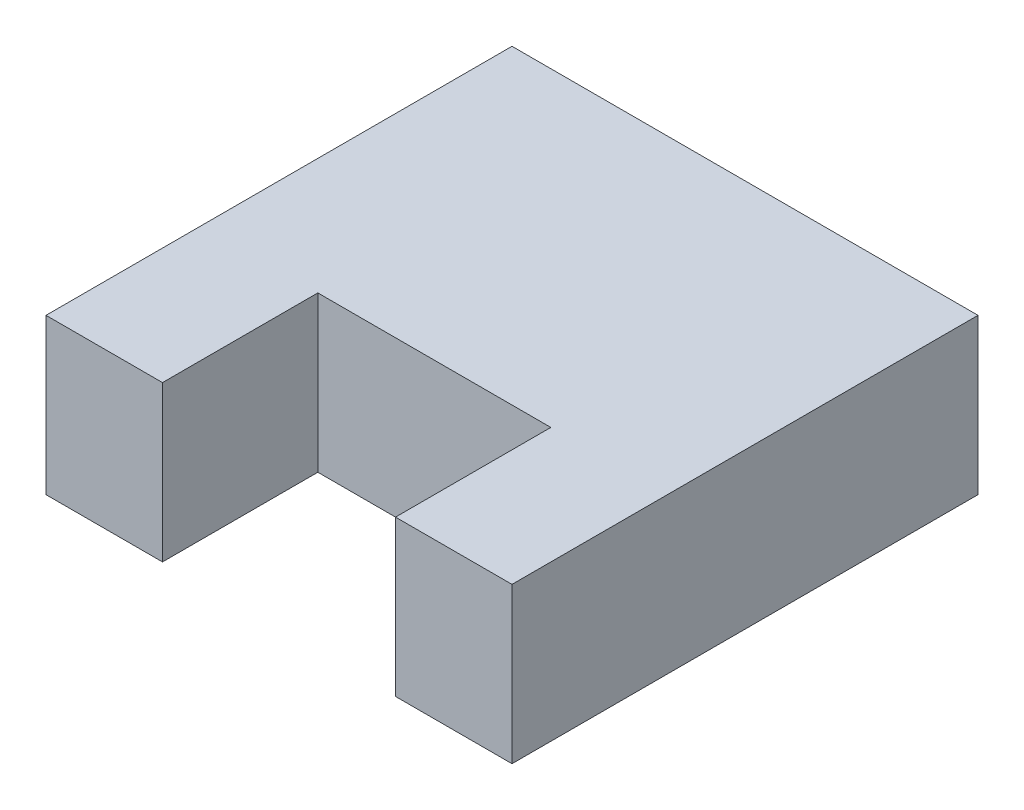
ISO-10303-21;
HEADER;
FILE_DESCRIPTION(('STEP AP214'),'2;1');
FILE_NAME('part.step','',(''),(''),'','','');
FILE_SCHEMA(('AUTOMOTIVE_DESIGN { 1 0 10303 214 1 1 1 1 }'));
ENDSEC;
DATA;
#1=APPLICATION_CONTEXT('core data for automotive mechanical design processes');
#2=APPLICATION_PROTOCOL_DEFINITION('international standard','automotive_design',2000,#1);
#3=PRODUCT_CONTEXT('',#1,'mechanical');
#4=PRODUCT('Part','Part','',(#3));
#5=PRODUCT_RELATED_PRODUCT_CATEGORY('part','',(#4));
#6=PRODUCT_DEFINITION_FORMATION('','',#4);
#7=PRODUCT_DEFINITION_CONTEXT('part definition',#1,'design');
#8=PRODUCT_DEFINITION('design','',#6,#7);
#9=PRODUCT_DEFINITION_SHAPE('','',#8);
#10=(LENGTH_UNIT() NAMED_UNIT(*) SI_UNIT(.MILLI.,.METRE.));
#11=(NAMED_UNIT(*) PLANE_ANGLE_UNIT() SI_UNIT($,.RADIAN.));
#12=(NAMED_UNIT(*) SI_UNIT($,.STERADIAN.) SOLID_ANGLE_UNIT());
#13=UNCERTAINTY_MEASURE_WITH_UNIT(LENGTH_MEASURE(1.E-05),#10,'distance_accuracy_value','');
#14=(GEOMETRIC_REPRESENTATION_CONTEXT(3) GLOBAL_UNCERTAINTY_ASSIGNED_CONTEXT((#13)) GLOBAL_UNIT_ASSIGNED_CONTEXT((#10,
#11,#12)) REPRESENTATION_CONTEXT('',''));
#15=CARTESIAN_POINT('',(0.,0.,0.));
#16=DIRECTION('',(0.,0.,1.));
#17=DIRECTION('',(1.,0.,0.));
#18=AXIS2_PLACEMENT_3D('',#15,#16,#17);
#19=CARTESIAN_POINT('',(0.,10.,60.));
#20=DIRECTION('',(1.,0.,0.));
#21=DIRECTION('',(0.,0.,-1.));
#22=AXIS2_PLACEMENT_3D('',#19,#20,#21);
#23=PLANE('',#22);
#24=DIRECTION('',(0.,0.,1.));
#25=VECTOR('',#24,1.);
#26=CARTESIAN_POINT('',(0.,-10.,60.));
#27=LINE('',#26,#25);
#28=CARTESIAN_POINT('',(0.,-10.,0.));
#29=VERTEX_POINT('',#28);
#30=CARTESIAN_POINT('',(0.,-10.,60.));
#31=VERTEX_POINT('',#30);
#32=EDGE_CURVE('E140',#29,#31,#27,.T.);
#33=ORIENTED_EDGE('',*,*,#32,.T.);
#34=DIRECTION('',(0.,-1.,0.));
#35=VECTOR('',#34,1.);
#36=CARTESIAN_POINT('',(0.,10.,60.));
#37=LINE('',#36,#35);
#38=CARTESIAN_POINT('',(0.,10.,60.));
#39=VERTEX_POINT('',#38);
#40=EDGE_CURVE('E11',#39,#31,#37,.T.);
#41=ORIENTED_EDGE('',*,*,#40,.F.);
#42=DIRECTION('',(0.,0.,1.));
#43=VECTOR('',#42,1.);
#44=CARTESIAN_POINT('',(0.,10.,60.));
#45=LINE('',#44,#43);
#46=CARTESIAN_POINT('',(0.,10.,0.));
#47=VERTEX_POINT('',#46);
#48=EDGE_CURVE('E162',#47,#39,#45,.T.);
#49=ORIENTED_EDGE('',*,*,#48,.F.);
#50=DIRECTION('',(0.,-1.,0.));
#51=VECTOR('',#50,1.);
#52=CARTESIAN_POINT('',(0.,10.,0.));
#53=LINE('',#52,#51);
#54=EDGE_CURVE('E136',#47,#29,#53,.T.);
#55=ORIENTED_EDGE('',*,*,#54,.T.);
#56=EDGE_LOOP('',(#33,#41,#49,#55));
#57=FACE_BOUND('',#56,.T.);
#58=ADVANCED_FACE('F39',(#57),#23,.F.);
#59=CARTESIAN_POINT('',(15.,10.,60.));
#60=DIRECTION('',(0.,0.,-1.));
#61=DIRECTION('',(-1.,0.,0.));
#62=AXIS2_PLACEMENT_3D('',#59,#60,#61);
#63=PLANE('',#62);
#64=DIRECTION('',(1.,0.,0.));
#65=VECTOR('',#64,1.);
#66=CARTESIAN_POINT('',(15.,-10.,60.));
#67=LINE('',#66,#65);
#68=CARTESIAN_POINT('',(15.,-10.,60.));
#69=VERTEX_POINT('',#68);
#70=EDGE_CURVE('E144',#31,#69,#67,.T.);
#71=ORIENTED_EDGE('',*,*,#70,.T.);
#72=DIRECTION('',(0.,-1.,0.));
#73=VECTOR('',#72,1.);
#74=CARTESIAN_POINT('',(15.,10.,60.));
#75=LINE('',#74,#73);
#76=CARTESIAN_POINT('',(15.,10.,60.));
#77=VERTEX_POINT('',#76);
#78=EDGE_CURVE('E48',#77,#69,#75,.T.);
#79=ORIENTED_EDGE('',*,*,#78,.F.);
#80=DIRECTION('',(1.,0.,0.));
#81=VECTOR('',#80,1.);
#82=CARTESIAN_POINT('',(15.,10.,60.));
#83=LINE('',#82,#81);
#84=EDGE_CURVE('E99',#39,#77,#83,.T.);
#85=ORIENTED_EDGE('',*,*,#84,.F.);
#86=ORIENTED_EDGE('',*,*,#40,.T.);
#87=EDGE_LOOP('',(#71,#79,#85,#86));
#88=FACE_BOUND('',#87,.T.);
#89=ADVANCED_FACE('F208',(#88),#63,.F.);
#90=CARTESIAN_POINT('',(15.,10.,40.));
#91=DIRECTION('',(-1.,0.,0.));
#92=DIRECTION('',(0.,0.,1.));
#93=AXIS2_PLACEMENT_3D('',#90,#91,#92);
#94=PLANE('',#93);
#95=DIRECTION('',(0.,0.,-1.));
#96=VECTOR('',#95,1.);
#97=CARTESIAN_POINT('',(15.,-10.,40.));
#98=LINE('',#97,#96);
#99=CARTESIAN_POINT('',(15.,-10.,40.));
#100=VERTEX_POINT('',#99);
#101=EDGE_CURVE('E147',#69,#100,#98,.T.);
#102=ORIENTED_EDGE('',*,*,#101,.T.);
#103=DIRECTION('',(0.,-1.,0.));
#104=VECTOR('',#103,1.);
#105=CARTESIAN_POINT('',(15.,10.,40.));
#106=LINE('',#105,#104);
#107=CARTESIAN_POINT('',(15.,10.,40.));
#108=VERTEX_POINT('',#107);
#109=EDGE_CURVE('E173',#108,#100,#106,.T.);
#110=ORIENTED_EDGE('',*,*,#109,.F.);
#111=DIRECTION('',(0.,0.,-1.));
#112=VECTOR('',#111,1.);
#113=CARTESIAN_POINT('',(15.,10.,40.));
#114=LINE('',#113,#112);
#115=EDGE_CURVE('E183',#77,#108,#114,.T.);
#116=ORIENTED_EDGE('',*,*,#115,.F.);
#117=ORIENTED_EDGE('',*,*,#78,.T.);
#118=EDGE_LOOP('',(#102,#110,#116,#117));
#119=FACE_BOUND('',#118,.T.);
#120=ADVANCED_FACE('F181',(#119),#94,.F.);
#121=CARTESIAN_POINT('',(45.,10.,40.));
#122=DIRECTION('',(0.,0.,-1.));
#123=DIRECTION('',(-1.,0.,0.));
#124=AXIS2_PLACEMENT_3D('',#121,#122,#123);
#125=PLANE('',#124);
#126=DIRECTION('',(1.,0.,0.));
#127=VECTOR('',#126,1.);
#128=CARTESIAN_POINT('',(45.,-10.,40.));
#129=LINE('',#128,#127);
#130=CARTESIAN_POINT('',(45.,-10.,40.));
#131=VERTEX_POINT('',#130);
#132=EDGE_CURVE('E150',#100,#131,#129,.T.);
#133=ORIENTED_EDGE('',*,*,#132,.T.);
#134=DIRECTION('',(0.,-1.,0.));
#135=VECTOR('',#134,1.);
#136=CARTESIAN_POINT('',(45.,10.,40.));
#137=LINE('',#136,#135);
#138=CARTESIAN_POINT('',(45.,10.,40.));
#139=VERTEX_POINT('',#138);
#140=EDGE_CURVE('E169',#139,#131,#137,.T.);
#141=ORIENTED_EDGE('',*,*,#140,.F.);
#142=DIRECTION('',(1.,0.,0.));
#143=VECTOR('',#142,1.);
#144=CARTESIAN_POINT('',(45.,10.,40.));
#145=LINE('',#144,#143);
#146=EDGE_CURVE('E196',#108,#139,#145,.T.);
#147=ORIENTED_EDGE('',*,*,#146,.F.);
#148=ORIENTED_EDGE('',*,*,#109,.T.);
#149=EDGE_LOOP('',(#133,#141,#147,#148));
#150=FACE_BOUND('',#149,.T.);
#151=ADVANCED_FACE('F191',(#150),#125,.F.);
#152=CARTESIAN_POINT('',(45.,10.,60.));
#153=DIRECTION('',(1.,0.,0.));
#154=DIRECTION('',(0.,0.,-1.));
#155=AXIS2_PLACEMENT_3D('',#152,#153,#154);
#156=PLANE('',#155);
#157=DIRECTION('',(0.,0.,1.));
#158=VECTOR('',#157,1.);
#159=CARTESIAN_POINT('',(45.,-10.,60.));
#160=LINE('',#159,#158);
#161=CARTESIAN_POINT('',(45.,-10.,60.));
#162=VERTEX_POINT('',#161);
#163=EDGE_CURVE('E153',#131,#162,#160,.T.);
#164=ORIENTED_EDGE('',*,*,#163,.T.);
#165=DIRECTION('',(0.,-1.,0.));
#166=VECTOR('',#165,1.);
#167=CARTESIAN_POINT('',(45.,10.,60.));
#168=LINE('',#167,#166);
#169=CARTESIAN_POINT('',(45.,10.,60.));
#170=VERTEX_POINT('',#169);
#171=EDGE_CURVE('E129',#170,#162,#168,.T.);
#172=ORIENTED_EDGE('',*,*,#171,.F.);
#173=DIRECTION('',(0.,0.,1.));
#174=VECTOR('',#173,1.);
#175=CARTESIAN_POINT('',(45.,10.,60.));
#176=LINE('',#175,#174);
#177=EDGE_CURVE('E118',#139,#170,#176,.T.);
#178=ORIENTED_EDGE('',*,*,#177,.F.);
#179=ORIENTED_EDGE('',*,*,#140,.T.);
#180=EDGE_LOOP('',(#164,#172,#178,#179));
#181=FACE_BOUND('',#180,.T.);
#182=ADVANCED_FACE('F194',(#181),#156,.F.);
#183=CARTESIAN_POINT('',(60.,10.,60.));
#184=DIRECTION('',(0.,0.,-1.));
#185=DIRECTION('',(-1.,0.,0.));
#186=AXIS2_PLACEMENT_3D('',#183,#184,#185);
#187=PLANE('',#186);
#188=DIRECTION('',(1.,0.,0.));
#189=VECTOR('',#188,1.);
#190=CARTESIAN_POINT('',(60.,-10.,60.));
#191=LINE('',#190,#189);
#192=CARTESIAN_POINT('',(60.,-10.,60.));
#193=VERTEX_POINT('',#192);
#194=EDGE_CURVE('E127',#162,#193,#191,.T.);
#195=ORIENTED_EDGE('',*,*,#194,.T.);
#196=DIRECTION('',(0.,-1.,0.));
#197=VECTOR('',#196,1.);
#198=CARTESIAN_POINT('',(60.,10.,60.));
#199=LINE('',#198,#197);
#200=CARTESIAN_POINT('',(60.,10.,60.));
#201=VERTEX_POINT('',#200);
#202=EDGE_CURVE('E124',#201,#193,#199,.T.);
#203=ORIENTED_EDGE('',*,*,#202,.F.);
#204=DIRECTION('',(1.,0.,0.));
#205=VECTOR('',#204,1.);
#206=CARTESIAN_POINT('',(60.,10.,60.));
#207=LINE('',#206,#205);
#208=EDGE_CURVE('E112',#170,#201,#207,.T.);
#209=ORIENTED_EDGE('',*,*,#208,.F.);
#210=ORIENTED_EDGE('',*,*,#171,.T.);
#211=EDGE_LOOP('',(#195,#203,#209,#210));
#212=FACE_BOUND('',#211,.T.);
#213=ADVANCED_FACE('F125',(#212),#187,.F.);
#214=CARTESIAN_POINT('',(60.,10.,0.));
#215=DIRECTION('',(-1.,0.,0.));
#216=DIRECTION('',(0.,0.,1.));
#217=AXIS2_PLACEMENT_3D('',#214,#215,#216);
#218=PLANE('',#217);
#219=DIRECTION('',(0.,0.,-1.));
#220=VECTOR('',#219,1.);
#221=CARTESIAN_POINT('',(60.,-10.,0.));
#222=LINE('',#221,#220);
#223=CARTESIAN_POINT('',(60.,-10.,0.));
#224=VERTEX_POINT('',#223);
#225=EDGE_CURVE('E85',#193,#224,#222,.T.);
#226=ORIENTED_EDGE('',*,*,#225,.T.);
#227=DIRECTION('',(0.,-1.,0.));
#228=VECTOR('',#227,1.);
#229=CARTESIAN_POINT('',(60.,10.,0.));
#230=LINE('',#229,#228);
#231=CARTESIAN_POINT('',(60.,10.,0.));
#232=VERTEX_POINT('',#231);
#233=EDGE_CURVE('E130',#232,#224,#230,.T.);
#234=ORIENTED_EDGE('',*,*,#233,.F.);
#235=DIRECTION('',(0.,0.,-1.));
#236=VECTOR('',#235,1.);
#237=CARTESIAN_POINT('',(60.,10.,0.));
#238=LINE('',#237,#236);
#239=EDGE_CURVE('E116',#201,#232,#238,.T.);
#240=ORIENTED_EDGE('',*,*,#239,.F.);
#241=ORIENTED_EDGE('',*,*,#202,.T.);
#242=EDGE_LOOP('',(#226,#234,#240,#241));
#243=FACE_BOUND('',#242,.T.);
#244=ADVANCED_FACE('F132',(#243),#218,.F.);
#245=CARTESIAN_POINT('',(0.,10.,0.));
#246=DIRECTION('',(0.,0.,1.));
#247=DIRECTION('',(1.,0.,0.));
#248=AXIS2_PLACEMENT_3D('',#245,#246,#247);
#249=PLANE('',#248);
#250=DIRECTION('',(-1.,0.,0.));
#251=VECTOR('',#250,1.);
#252=CARTESIAN_POINT('',(0.,-10.,0.));
#253=LINE('',#252,#251);
#254=EDGE_CURVE('E91',#224,#29,#253,.T.);
#255=ORIENTED_EDGE('',*,*,#254,.T.);
#256=ORIENTED_EDGE('',*,*,#54,.F.);
#257=DIRECTION('',(-1.,0.,0.));
#258=VECTOR('',#257,1.);
#259=CARTESIAN_POINT('',(0.,10.,0.));
#260=LINE('',#259,#258);
#261=EDGE_CURVE('E56',#232,#47,#260,.T.);
#262=ORIENTED_EDGE('',*,*,#261,.F.);
#263=ORIENTED_EDGE('',*,*,#233,.T.);
#264=EDGE_LOOP('',(#255,#256,#262,#263));
#265=FACE_BOUND('',#264,.T.);
#266=ADVANCED_FACE('F224',(#265),#249,.F.);
#267=CARTESIAN_POINT('',(0.,10.,0.));
#268=DIRECTION('',(0.,-1.,0.));
#269=DIRECTION('',(0.,0.,-1.));
#270=AXIS2_PLACEMENT_3D('',#267,#268,#269);
#271=PLANE('',#270);
#272=ORIENTED_EDGE('',*,*,#48,.T.);
#273=ORIENTED_EDGE('',*,*,#84,.T.);
#274=ORIENTED_EDGE('',*,*,#115,.T.);
#275=ORIENTED_EDGE('',*,*,#146,.T.);
#276=ORIENTED_EDGE('',*,*,#177,.T.);
#277=ORIENTED_EDGE('',*,*,#208,.T.);
#278=ORIENTED_EDGE('',*,*,#239,.T.);
#279=ORIENTED_EDGE('',*,*,#261,.T.);
#280=EDGE_LOOP('',(#272,#273,#274,#275,#276,#277,#278,#279));
#281=FACE_BOUND('',#280,.T.);
#282=ADVANCED_FACE('F114',(#281),#271,.F.);
#283=CARTESIAN_POINT('',(0.,-10.,0.));
#284=DIRECTION('',(0.,-1.,0.));
#285=DIRECTION('',(0.,0.,-1.));
#286=AXIS2_PLACEMENT_3D('',#283,#284,#285);
#287=PLANE('',#286);
#288=ORIENTED_EDGE('',*,*,#32,.F.);
#289=ORIENTED_EDGE('',*,*,#254,.F.);
#290=ORIENTED_EDGE('',*,*,#225,.F.);
#291=ORIENTED_EDGE('',*,*,#194,.F.);
#292=ORIENTED_EDGE('',*,*,#163,.F.);
#293=ORIENTED_EDGE('',*,*,#132,.F.);
#294=ORIENTED_EDGE('',*,*,#101,.F.);
#295=ORIENTED_EDGE('',*,*,#70,.F.);
#296=EDGE_LOOP('',(#288,#289,#290,#291,#292,#293,#294,#295));
#297=FACE_BOUND('',#296,.T.);
#298=ADVANCED_FACE('F187',(#297),#287,.T.);
#299=CLOSED_SHELL('',(#58,#89,#120,#151,#182,#213,#244,#266,#282,#298));
#300=MANIFOLD_SOLID_BREP('B2',#299);
#301=ADVANCED_BREP_SHAPE_REPRESENTATION('',(#18,#300),#14);
#302=SHAPE_DEFINITION_REPRESENTATION(#9,#301);
ENDSEC;
END-ISO-10303-21;
